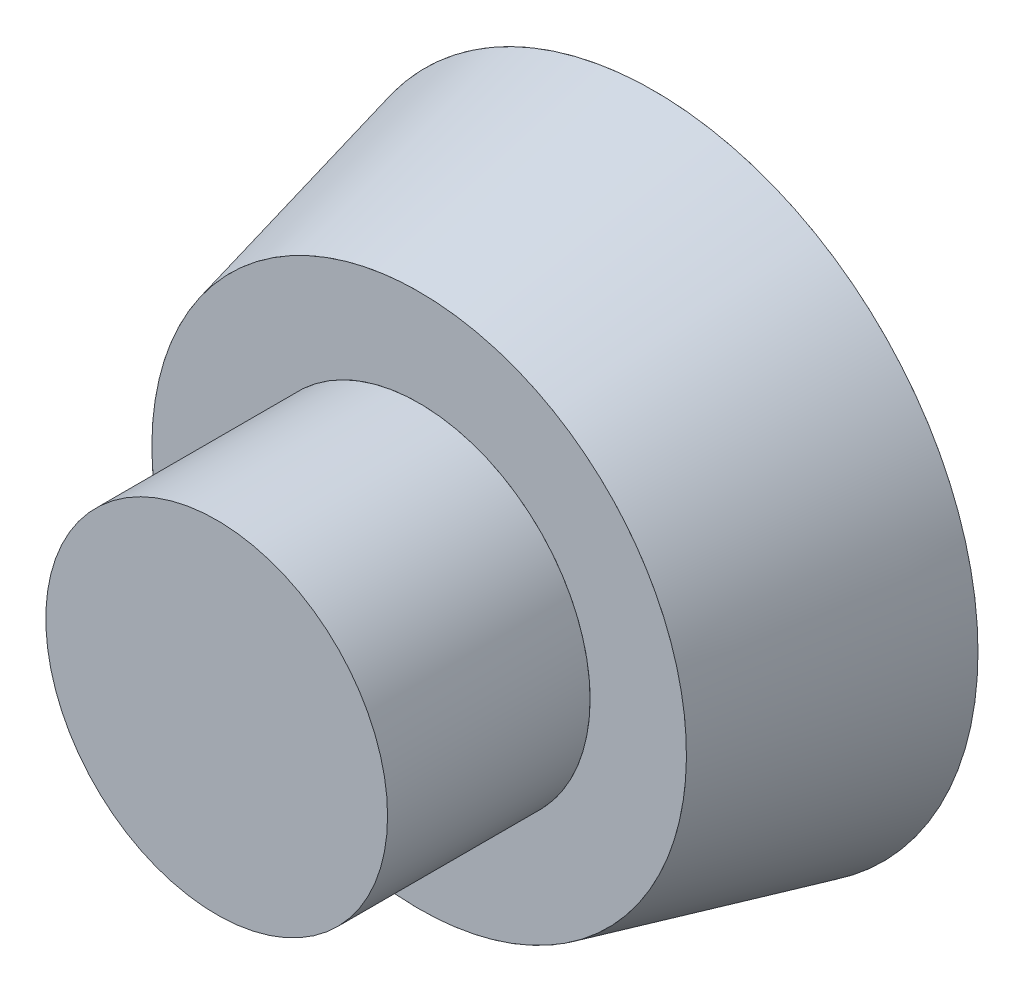
ISO-10303-21;
HEADER;
FILE_DESCRIPTION(('STEP AP214'),'2;1');
FILE_NAME('part.step','',(''),(''),'','','');
FILE_SCHEMA(('AUTOMOTIVE_DESIGN { 1 0 10303 214 1 1 1 1 }'));
ENDSEC;
DATA;
#1=APPLICATION_CONTEXT('core data for automotive mechanical design processes');
#2=APPLICATION_PROTOCOL_DEFINITION('international standard','automotive_design',2000,#1);
#3=PRODUCT_CONTEXT('',#1,'mechanical');
#4=PRODUCT('Part','Part','',(#3));
#5=PRODUCT_RELATED_PRODUCT_CATEGORY('part','',(#4));
#6=PRODUCT_DEFINITION_FORMATION('','',#4);
#7=PRODUCT_DEFINITION_CONTEXT('part definition',#1,'design');
#8=PRODUCT_DEFINITION('design','',#6,#7);
#9=PRODUCT_DEFINITION_SHAPE('','',#8);
#10=(LENGTH_UNIT() NAMED_UNIT(*) SI_UNIT(.MILLI.,.METRE.));
#11=(NAMED_UNIT(*) PLANE_ANGLE_UNIT() SI_UNIT($,.RADIAN.));
#12=(NAMED_UNIT(*) SI_UNIT($,.STERADIAN.) SOLID_ANGLE_UNIT());
#13=UNCERTAINTY_MEASURE_WITH_UNIT(LENGTH_MEASURE(1.E-05),#10,'distance_accuracy_value','');
#14=(GEOMETRIC_REPRESENTATION_CONTEXT(3) GLOBAL_UNCERTAINTY_ASSIGNED_CONTEXT((#13)) GLOBAL_UNIT_ASSIGNED_CONTEXT((#10,
#11,#12)) REPRESENTATION_CONTEXT('',''));
#15=CARTESIAN_POINT('',(0.,0.,0.));
#16=DIRECTION('',(0.,0.,1.));
#17=DIRECTION('',(1.,0.,0.));
#18=AXIS2_PLACEMENT_3D('',#15,#16,#17);
#19=CARTESIAN_POINT('',(0.,0.,54.));
#20=DIRECTION('',(0.,0.,-1.));
#21=DIRECTION('',(-1.,0.,0.));
#22=AXIS2_PLACEMENT_3D('',#19,#20,#21);
#23=CYLINDRICAL_SURFACE('',#22,21.1);
#24=CARTESIAN_POINT('',(0.,0.,54.));
#25=DIRECTION('',(0.,0.,1.));
#26=DIRECTION('',(1.,0.,0.));
#27=AXIS2_PLACEMENT_3D('',#24,#25,#26);
#28=CIRCLE('',#27,21.1);
#29=CARTESIAN_POINT('',(21.1,0.,54.));
#30=VERTEX_POINT('',#29);
#31=EDGE_CURVE('E11',#30,#30,#28,.T.);
#32=ORIENTED_EDGE('',*,*,#31,.F.);
#33=EDGE_LOOP('',(#32));
#34=FACE_BOUND('',#33,.T.);
#35=CARTESIAN_POINT('',(0.,0.,29.));
#36=DIRECTION('',(0.,0.,1.));
#37=DIRECTION('',(1.,0.,0.));
#38=AXIS2_PLACEMENT_3D('',#35,#36,#37);
#39=CIRCLE('',#38,21.1);
#40=CARTESIAN_POINT('',(21.1,0.,29.));
#41=VERTEX_POINT('',#40);
#42=EDGE_CURVE('E44',#41,#41,#39,.T.);
#43=ORIENTED_EDGE('',*,*,#42,.T.);
#44=EDGE_LOOP('',(#43));
#45=FACE_BOUND('',#44,.T.);
#46=ADVANCED_FACE('F41',(#34,#45),#23,.T.);
#47=CARTESIAN_POINT('',(0.,0.,54.));
#48=DIRECTION('',(0.,0.,1.));
#49=DIRECTION('',(1.,0.,0.));
#50=AXIS2_PLACEMENT_3D('',#47,#48,#49);
#51=PLANE('',#50);
#52=ORIENTED_EDGE('',*,*,#31,.T.);
#53=EDGE_LOOP('',(#52));
#54=FACE_BOUND('',#53,.T.);
#55=ADVANCED_FACE('F56',(#54),#51,.T.);
#56=CARTESIAN_POINT('',(0.,0.,29.));
#57=DIRECTION('',(0.,0.,1.));
#58=DIRECTION('',(1.,0.,0.));
#59=AXIS2_PLACEMENT_3D('',#56,#57,#58);
#60=PLANE('',#59);
#61=ORIENTED_EDGE('',*,*,#42,.F.);
#62=EDGE_LOOP('',(#61));
#63=FACE_BOUND('',#62,.T.);
#64=ADVANCED_FACE('F54',(#63),#60,.F.);
#65=CLOSED_SHELL('',(#46,#55,#64));
#66=MANIFOLD_SOLID_BREP('B2',#65);
#67=CARTESIAN_POINT('',(11.0458613208023,31.1268304310221,29.));
#68=DIRECTION('',(0.,0.,-1.));
#69=DIRECTION('',(0.927679935747569,-0.373376400983492,0.));
#70=AXIS2_PLACEMENT_3D('',#67,#68,#69);
#71=PLANE('',#70);
#72=CARTESIAN_POINT('',(12.3214212324552,30.6134378796698,29.));
#73=CARTESIAN_POINT('',(13.5969811441081,30.1000453283175,29.));
#74=CARTESIAN_POINT('',(14.9212131826403,29.475129725323,29.));
#75=CARTESIAN_POINT('',(17.6310124143514,27.9387414965564,29.));
#76=CARTESIAN_POINT('',(19.0169188604302,27.0269198588337,29.));
#77=CARTESIAN_POINT('',(21.783735118499,24.8508849799574,29.));
#78=CARTESIAN_POINT('',(23.1648635496074,23.5860067428627,29.));
#79=CARTESIAN_POINT('',(25.8157606280003,20.6508382528188,29.));
#80=CARTESIAN_POINT('',(27.0853398761486,18.9795775451804,29.));
#81=CARTESIAN_POINT('',(29.3650595513836,15.216217583345,29.));
#82=CARTESIAN_POINT('',(30.3742646931361,13.1231386180522,29.));
#83=CARTESIAN_POINT('',(31.959086061376,8.5691038597317,29.));
#84=CARTESIAN_POINT('',(32.5329585958328,6.10782833252108,29.));
#85=CARTESIAN_POINT('',(33.08738705766,0.961134555776558,29.));
#86=CARTESIAN_POINT('',(33.0660253335009,-1.7232429536826,29.));
#87=CARTESIAN_POINT('',(32.3428770092217,-7.09012724847009,29.));
#88=CARTESIAN_POINT('',(31.6402229823744,-9.77030140914941,29.));
#89=CARTESIAN_POINT('',(29.5866527769652,-14.872541055761,29.));
#90=CARTESIAN_POINT('',(28.2367087026425,-17.2921912803222,29.));
#91=CARTESIAN_POINT('',(25.0403327342779,-21.6636408341208,29.));
#92=CARTESIAN_POINT('',(23.19614233126,-23.6143588285951,29.));
#93=CARTESIAN_POINT('',(19.2309398258465,-26.9419731154269,29.));
#94=CARTESIAN_POINT('',(17.1120316658035,-28.3194472952041,29.));
#95=CARTESIAN_POINT('',(12.8142933814291,-30.5058454721709,29.));
#96=CARTESIAN_POINT('',(10.6364992780516,-31.3162079937531,29.));
#97=CARTESIAN_POINT('',(6.38535220562377,-32.4509980926648,29.));
#98=CARTESIAN_POINT('',(4.31199505326716,-32.7767801348286,29.));
#99=CARTESIAN_POINT('',(0.366889861580129,-33.0571627514487,29.));
#100=CARTESIAN_POINT('',(-1.50539386700572,-33.0125944043358,29.));
#101=CARTESIAN_POINT('',(-5.00820968669323,-32.6652022148052,29.));
#102=CARTESIAN_POINT('',(-6.63936011589479,-32.3627065063768,29.));
#103=CARTESIAN_POINT('',(-9.65794271313067,-31.5935122725585,29.));
#104=CARTESIAN_POINT('',(-11.0458613208023,-31.1268304310221,29.));
#105=CARTESIAN_POINT('',(-13.5969811441081,-30.1000453283175,29.));
#106=CARTESIAN_POINT('',(-14.9212131826403,-29.475129725323,29.));
#107=CARTESIAN_POINT('',(-17.6310124143514,-27.9387414965564,29.));
#108=CARTESIAN_POINT('',(-19.0169188604301,-27.0269198588337,29.));
#109=CARTESIAN_POINT('',(-21.783735118499,-24.8508849799574,29.));
#110=CARTESIAN_POINT('',(-23.1648635496074,-23.5860067428627,29.));
#111=CARTESIAN_POINT('',(-25.8157606280003,-20.6508382528188,29.));
#112=CARTESIAN_POINT('',(-27.0853398761486,-18.9795775451804,29.));
#113=CARTESIAN_POINT('',(-29.3650595513836,-15.216217583345,29.));
#114=CARTESIAN_POINT('',(-30.3742646931361,-13.1231386180522,29.));
#115=CARTESIAN_POINT('',(-31.959086061376,-8.5691038597317,29.));
#116=CARTESIAN_POINT('',(-32.5329585958328,-6.10782833252109,29.));
#117=CARTESIAN_POINT('',(-33.08738705766,-0.961134555776557,29.));
#118=CARTESIAN_POINT('',(-33.0660253335008,1.7232429536826,29.));
#119=CARTESIAN_POINT('',(-32.3428770092217,7.09012724847009,29.));
#120=CARTESIAN_POINT('',(-31.6402229823744,9.77030140914943,29.));
#121=CARTESIAN_POINT('',(-29.5866527769652,14.872541055761,29.));
#122=CARTESIAN_POINT('',(-28.2367087026425,17.2921912803222,29.));
#123=CARTESIAN_POINT('',(-25.0403327342779,21.6636408341208,29.));
#124=CARTESIAN_POINT('',(-23.19614233126,23.614358828595,29.));
#125=CARTESIAN_POINT('',(-19.2309398258465,26.9419731154269,29.));
#126=CARTESIAN_POINT('',(-17.1120316658035,28.3194472952041,29.));
#127=CARTESIAN_POINT('',(-12.8142933814291,30.5058454721709,29.));
#128=CARTESIAN_POINT('',(-10.6364992780516,31.3162079937531,29.));
#129=CARTESIAN_POINT('',(-6.38535220562377,32.4509980926648,29.));
#130=CARTESIAN_POINT('',(-4.31199505326715,32.7767801348286,29.));
#131=CARTESIAN_POINT('',(-0.366889861580126,33.0571627514486,29.));
#132=CARTESIAN_POINT('',(1.50539386700572,33.0125944043358,29.));
#133=CARTESIAN_POINT('',(5.00820968669324,32.6652022148052,29.));
#134=CARTESIAN_POINT('',(6.63936011589479,32.3627065063768,29.));
#135=CARTESIAN_POINT('',(9.65794271313068,31.5935122725585,29.));
#136=CARTESIAN_POINT('',(11.0458613208023,31.1268304310221,29.));
#137=CARTESIAN_POINT('',(12.3214212324552,30.6134378796698,29.));
#138=B_SPLINE_CURVE_WITH_KNOTS('',3,(#72,#73,#74,#75,#76,#77,#78,#79,#80,#81,#82,#83,#84,#85,
#86,#87,#88,#89,#90,#91,#92,#93,#94,#95,#96,#97,#98,#99,#100,#101,#102,#103,#104,#105,#106,#107,
#108,#109,#110,#111,#112,#113,#114,#115,#116,#117,#118,#119,#120,#121,#122,#123,#124,#125,#126,
#127,#128,#129,#130,#131,#132,#133,#134,#135,#136,#137),.UNSPECIFIED.,.T.,.F.,(4,2,2,2,2,2,2,2,
2,2,2,2,2,2,2,2,2,2,2,2,2,2,2,2,2,2,2,2,2,2,2,2,4),(0.,0.03125,0.0625,0.09375,0.125,0.15625,
0.1875,0.21875,0.25,0.28125,0.3125,0.34375,0.375,0.40625,0.4375,0.46875,0.5,0.53125,0.5625,
0.59375,0.625,0.65625,0.6875,0.71875,0.75,0.78125,0.8125,0.84375,0.875,0.90625,0.9375,0.96875,
1.),.UNSPECIFIED.);
#139=CARTESIAN_POINT('',(12.3214212324552,30.6134378796698,29.));
#140=VERTEX_POINT('',#139);
#141=EDGE_CURVE('E40',#140,#140,#138,.T.);
#142=ORIENTED_EDGE('',*,*,#141,.T.);
#143=EDGE_LOOP('',(#142));
#144=FACE_BOUND('',#143,.T.);
#145=CARTESIAN_POINT('',(7.93969676320307,19.5491998636359,29.));
#146=CARTESIAN_POINT('',(8.75424675752123,19.2183791651691,29.));
#147=CARTESIAN_POINT('',(9.59969324351727,18.8161538869808,29.));
#148=CARTESIAN_POINT('',(11.3292277376028,17.828358206456,29.));
#149=CARTESIAN_POINT('',(12.2135319598053,17.2425639676333,29.));
#150=CARTESIAN_POINT('',(13.9782377491807,15.845669583154,29.));
#151=CARTESIAN_POINT('',(14.8587777636175,15.0341438060783,29.));
#152=CARTESIAN_POINT('',(16.5478410170127,13.1520992349544,29.));
#153=CARTESIAN_POINT('',(17.3562412065449,12.0809603215698,29.));
#154=CARTESIAN_POINT('',(18.8063134509431,9.67012334440397,29.));
#155=CARTESIAN_POINT('',(19.4473855250286,8.32980074109586,29.));
#156=CARTESIAN_POINT('',(20.4515579580871,5.41480943639334,29.));
#157=CARTESIAN_POINT('',(20.8135427741917,3.83993980248416,29.));
#158=CARTESIAN_POINT('',(21.1577009975923,0.548077545873655,29.));
#159=CARTESIAN_POINT('',(21.1386503667202,-1.16824578520557,29.));
#160=CARTESIAN_POINT('',(20.6654954677509,-4.59832954598268,29.));
#161=CARTESIAN_POINT('',(20.2108412605695,-6.31059677456674,29.));
#162=CARTESIAN_POINT('',(18.8875584667023,-9.56879675183939,29.));
#163=CARTESIAN_POINT('',(18.0195562860728,-11.1131871573435,29.));
#164=CARTESIAN_POINT('',(15.9670419661676,-13.9018311165017,29.));
#165=CARTESIAN_POINT('',(14.7839651876853,-15.1453977771836,29.));
#166=CARTESIAN_POINT('',(12.241967029834,-17.2650787354204,29.));
#167=CARTESIAN_POINT('',(10.8843897310061,-18.1415667550799,29.));
#168=CARTESIAN_POINT('',(8.1320636351919,-19.5308966813774,29.));
#169=CARTESIAN_POINT('',(6.73797437087447,-20.0446604483226,29.));
#170=CARTESIAN_POINT('',(4.01755064436372,-20.7616954493385,29.));
#171=CARTESIAN_POINT('',(2.69121078667323,-20.9658327073386,29.));
#172=CARTESIAN_POINT('',(0.168183676822396,-21.1371821882972,29.));
#173=CARTESIAN_POINT('',(-1.02884775950823,-21.1049247190997,29.));
#174=CARTESIAN_POINT('',(-3.26781810220555,-20.875769206475,29.));
#175=CARTESIAN_POINT('',(-4.31015302738145,-20.6790797268333,29.));
#176=CARTESIAN_POINT('',(-6.23866183145404,-20.1812005594546,29.));
#177=CARTESIAN_POINT('',(-7.1251467688849,-19.8800205621027,29.));
#178=CARTESIAN_POINT('',(-8.75424675752123,-19.2183791651691,29.));
#179=CARTESIAN_POINT('',(-9.59969324351728,-18.8161538869808,29.));
#180=CARTESIAN_POINT('',(-11.3292277376028,-17.828358206456,29.));
#181=CARTESIAN_POINT('',(-12.2135319598053,-17.2425639676333,29.));
#182=CARTESIAN_POINT('',(-13.9782377491807,-15.845669583154,29.));
#183=CARTESIAN_POINT('',(-14.8587777636175,-15.0341438060783,29.));
#184=CARTESIAN_POINT('',(-16.5478410170127,-13.1520992349544,29.));
#185=CARTESIAN_POINT('',(-17.3562412065449,-12.0809603215698,29.));
#186=CARTESIAN_POINT('',(-18.8063134509431,-9.67012334440397,29.));
#187=CARTESIAN_POINT('',(-19.4473855250286,-8.32980074109584,29.));
#188=CARTESIAN_POINT('',(-20.4515579580871,-5.41480943639334,29.));
#189=CARTESIAN_POINT('',(-20.8135427741917,-3.83993980248416,29.));
#190=CARTESIAN_POINT('',(-21.1577009975923,-0.548077545873653,29.));
#191=CARTESIAN_POINT('',(-21.1386503667202,1.16824578520557,29.));
#192=CARTESIAN_POINT('',(-20.6654954677509,4.59832954598269,29.));
#193=CARTESIAN_POINT('',(-20.2108412605695,6.31059677456675,29.));
#194=CARTESIAN_POINT('',(-18.8875584667023,9.56879675183938,29.));
#195=CARTESIAN_POINT('',(-18.0195562860728,11.1131871573435,29.));
#196=CARTESIAN_POINT('',(-15.9670419661676,13.9018311165017,29.));
#197=CARTESIAN_POINT('',(-14.7839651876853,15.1453977771836,29.));
#198=CARTESIAN_POINT('',(-12.241967029834,17.2650787354204,29.));
#199=CARTESIAN_POINT('',(-10.8843897310061,18.1415667550799,29.));
#200=CARTESIAN_POINT('',(-8.1320636351919,19.5308966813775,29.));
#201=CARTESIAN_POINT('',(-6.73797437087446,20.0446604483226,29.));
#202=CARTESIAN_POINT('',(-4.01755064436373,20.7616954493385,29.));
#203=CARTESIAN_POINT('',(-2.69121078667324,20.9658327073386,29.));
#204=CARTESIAN_POINT('',(-0.168183676822398,21.1371821882972,29.));
#205=CARTESIAN_POINT('',(1.02884775950824,21.1049247190997,29.));
#206=CARTESIAN_POINT('',(3.26781810220554,20.875769206475,29.));
#207=CARTESIAN_POINT('',(4.31015302738144,20.6790797268333,29.));
#208=CARTESIAN_POINT('',(6.23866183145404,20.1812005594546,29.));
#209=CARTESIAN_POINT('',(7.1251467688849,19.8800205621027,29.));
#210=CARTESIAN_POINT('',(7.93969676320307,19.5491998636359,29.));
#211=B_SPLINE_CURVE_WITH_KNOTS('',3,(#145,#146,#147,#148,#149,#150,#151,#152,#153,#154,#155,
#156,#157,#158,#159,#160,#161,#162,#163,#164,#165,#166,#167,#168,#169,#170,#171,#172,#173,#174,
#175,#176,#177,#178,#179,#180,#181,#182,#183,#184,#185,#186,#187,#188,#189,#190,#191,#192,#193,
#194,#195,#196,#197,#198,#199,#200,#201,#202,#203,#204,#205,#206,#207,#208,#209,#210),
.UNSPECIFIED.,.T.,.F.,(4,2,2,2,2,2,2,2,2,2,2,2,2,2,2,2,2,2,2,2,2,2,2,2,2,2,2,2,2,2,2,2,4),(0.,
0.03125,0.0625,0.09375,0.125,0.15625,0.1875,0.21875,0.25,0.28125,0.3125,0.34375,0.375,0.40625,
0.4375,0.46875,0.5,0.53125,0.5625,0.59375,0.625,0.65625,0.6875,0.71875,0.75,0.78125,0.8125,
0.84375,0.875,0.90625,0.9375,0.96875,1.),.UNSPECIFIED.);
#212=CARTESIAN_POINT('',(7.93969676320307,19.5491998636359,29.));
#213=VERTEX_POINT('',#212);
#214=EDGE_CURVE('E90',#213,#213,#211,.F.);
#215=ORIENTED_EDGE('',*,*,#214,.T.);
#216=EDGE_LOOP('',(#215));
#217=FACE_BOUND('',#216,.T.);
#218=ADVANCED_FACE('F89',(#144,#217),#71,.T.);
#219=OPEN_SHELL('',(#218));
#220=SHELL_BASED_SURFACE_MODEL('B6',(#219));
#221=CARTESIAN_POINT('',(0.,0.,29.));
#222=DIRECTION('',(0.,0.,-1.));
#223=DIRECTION('',(-1.,0.,0.));
#224=AXIS2_PLACEMENT_3D('',#221,#222,#223);
#225=CONICAL_SURFACE('',#224,33.,0.23684876094692);
#226=CARTESIAN_POINT('',(0.,0.,0.));
#227=DIRECTION('',(0.,0.,1.));
#228=DIRECTION('',(1.,0.,0.));
#229=AXIS2_PLACEMENT_3D('',#226,#227,#228);
#230=CIRCLE('',#229,40.);
#231=CARTESIAN_POINT('',(40.,0.,0.));
#232=VERTEX_POINT('',#231);
#233=EDGE_CURVE('E134',#232,#232,#230,.T.);
#234=ORIENTED_EDGE('',*,*,#233,.T.);
#235=EDGE_LOOP('',(#234));
#236=FACE_BOUND('',#235,.T.);
#237=CARTESIAN_POINT('',(0.,0.,29.));
#238=DIRECTION('',(0.,0.,-1.));
#239=DIRECTION('',(-1.,0.,0.));
#240=AXIS2_PLACEMENT_3D('',#237,#238,#239);
#241=CIRCLE('',#240,33.);
#242=CARTESIAN_POINT('',(-33.,0.,29.));
#243=VERTEX_POINT('',#242);
#244=EDGE_CURVE('E88',#243,#243,#241,.T.);
#245=ORIENTED_EDGE('',*,*,#244,.T.);
#246=EDGE_LOOP('',(#245));
#247=FACE_BOUND('',#246,.T.);
#248=ADVANCED_FACE('F130',(#236,#247),#225,.T.);
#249=OPEN_SHELL('',(#248));
#250=SHELL_BASED_SURFACE_MODEL('B35',(#249));
#251=CARTESIAN_POINT('',(0.,0.,0.));
#252=DIRECTION('',(0.,0.,1.));
#253=DIRECTION('',(1.,0.,0.));
#254=AXIS2_PLACEMENT_3D('',#251,#252,#253);
#255=PLANE('',#254);
#256=CARTESIAN_POINT('',(0.,0.,0.));
#257=DIRECTION('',(0.,0.,1.));
#258=DIRECTION('',(1.,0.,0.));
#259=AXIS2_PLACEMENT_3D('',#256,#257,#258);
#260=CIRCLE('',#259,40.);
#261=CARTESIAN_POINT('',(40.,0.,0.));
#262=VERTEX_POINT('',#261);
#263=EDGE_CURVE('E129',#262,#262,#260,.T.);
#264=ORIENTED_EDGE('',*,*,#263,.T.);
#265=EDGE_LOOP('',(#264));
#266=FACE_BOUND('',#265,.T.);
#267=ADVANCED_FACE('F154',(#266),#255,.T.);
#268=OPEN_SHELL('',(#267));
#269=SHELL_BASED_SURFACE_MODEL('B83',(#268));
#270=ADVANCED_BREP_SHAPE_REPRESENTATION('',(#18,#66),#14);
#271=MANIFOLD_SURFACE_SHAPE_REPRESENTATION('',(#18,#220,#250,#269),#14);
#272=SHAPE_REPRESENTATION('',(#18),#14);
#273=SHAPE_DEFINITION_REPRESENTATION(#9,#272);
#274=SHAPE_REPRESENTATION_RELATIONSHIP('','',#272,#270);
#275=SHAPE_REPRESENTATION_RELATIONSHIP('','',#272,#271);
ENDSEC;
END-ISO-10303-21;
